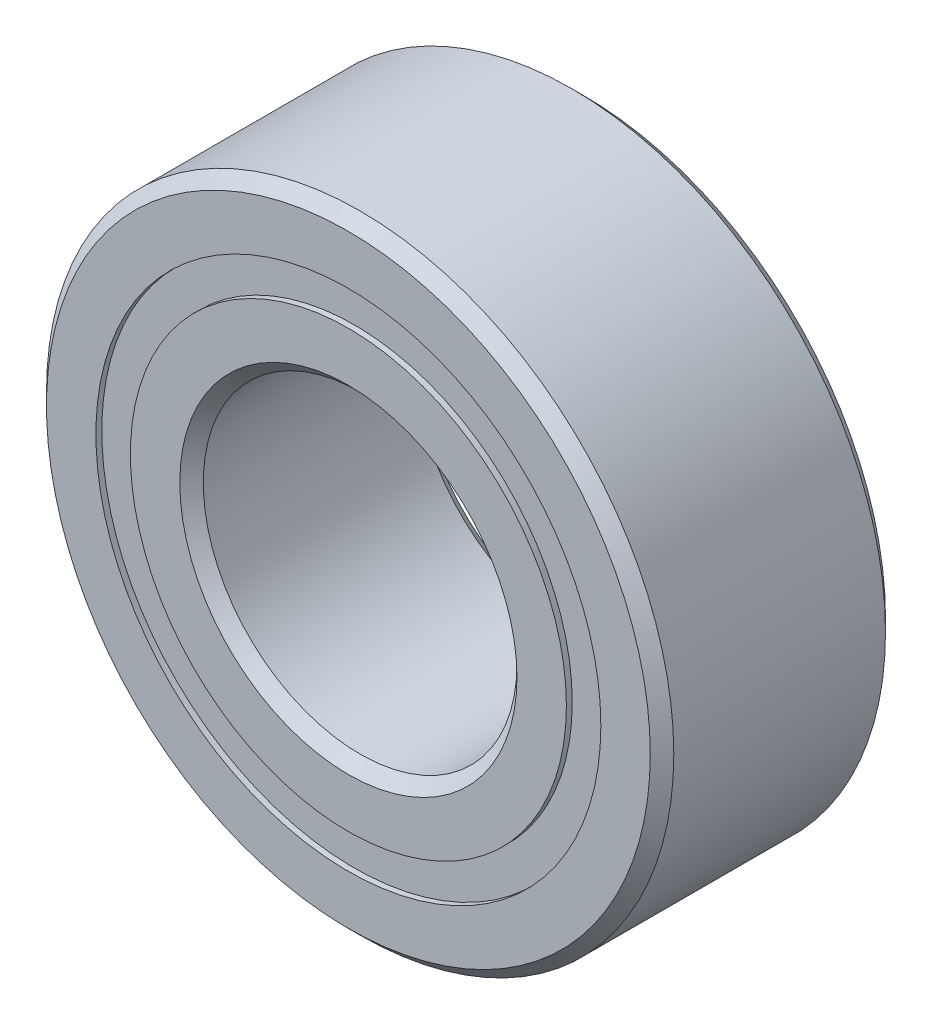
ISO-10303-21;
HEADER;
FILE_DESCRIPTION(('STEP AP214'),'2;1');
FILE_NAME('part.step','',(''),(''),'','','');
FILE_SCHEMA(('AUTOMOTIVE_DESIGN { 1 0 10303 214 1 1 1 1 }'));
ENDSEC;
DATA;
#1=APPLICATION_CONTEXT('core data for automotive mechanical design processes');
#2=APPLICATION_PROTOCOL_DEFINITION('international standard','automotive_design',2000,#1);
#3=PRODUCT_CONTEXT('',#1,'mechanical');
#4=PRODUCT('Part','Part','',(#3));
#5=PRODUCT_RELATED_PRODUCT_CATEGORY('part','',(#4));
#6=PRODUCT_DEFINITION_FORMATION('','',#4);
#7=PRODUCT_DEFINITION_CONTEXT('part definition',#1,'design');
#8=PRODUCT_DEFINITION('design','',#6,#7);
#9=PRODUCT_DEFINITION_SHAPE('','',#8);
#10=(LENGTH_UNIT() NAMED_UNIT(*) SI_UNIT(.MILLI.,.METRE.));
#11=(NAMED_UNIT(*) PLANE_ANGLE_UNIT() SI_UNIT($,.RADIAN.));
#12=(NAMED_UNIT(*) SI_UNIT($,.STERADIAN.) SOLID_ANGLE_UNIT());
#13=UNCERTAINTY_MEASURE_WITH_UNIT(LENGTH_MEASURE(1.E-05),#10,'distance_accuracy_value','');
#14=(GEOMETRIC_REPRESENTATION_CONTEXT(3) GLOBAL_UNCERTAINTY_ASSIGNED_CONTEXT((#13)) GLOBAL_UNIT_ASSIGNED_CONTEXT((#10,
#11,#12)) REPRESENTATION_CONTEXT('',''));
#15=CARTESIAN_POINT('',(0.,0.,0.));
#16=DIRECTION('',(0.,0.,1.));
#17=DIRECTION('',(1.,0.,0.));
#18=AXIS2_PLACEMENT_3D('',#15,#16,#17);
#19=CARTESIAN_POINT('',(0.,5.1114010989011,-2.2621875));
#20=DIRECTION('',(0.,0.,1.));
#21=DIRECTION('',(1.,0.,0.));
#22=AXIS2_PLACEMENT_3D('',#19,#20,#21);
#23=PLANE('',#22);
#24=CARTESIAN_POINT('',(0.,0.,-2.2621875));
#25=DIRECTION('',(0.,0.,1.));
#26=DIRECTION('',(1.,0.,0.));
#27=AXIS2_PLACEMENT_3D('',#24,#25,#26);
#28=CIRCLE('',#27,5.1114010989011);
#29=CARTESIAN_POINT('',(5.1114010989011,0.,-2.2621875));
#30=VERTEX_POINT('',#29);
#31=EDGE_CURVE('E58',#30,#30,#28,.T.);
#32=ORIENTED_EDGE('',*,*,#31,.F.);
#33=EDGE_LOOP('',(#32));
#34=FACE_BOUND('',#33,.T.);
#35=CARTESIAN_POINT('',(0.,0.,-2.2621875));
#36=DIRECTION('',(0.,0.,1.));
#37=DIRECTION('',(1.,0.,0.));
#38=AXIS2_PLACEMENT_3D('',#35,#36,#37);
#39=CIRCLE('',#38,4.4135989010989);
#40=CARTESIAN_POINT('',(4.4135989010989,0.,-2.2621875));
#41=VERTEX_POINT('',#40);
#42=EDGE_CURVE('E11',#41,#41,#39,.T.);
#43=ORIENTED_EDGE('',*,*,#42,.T.);
#44=EDGE_LOOP('',(#43));
#45=FACE_BOUND('',#44,.T.);
#46=ADVANCED_FACE('F44',(#34,#45),#23,.F.);
#47=CARTESIAN_POINT('',(0.,0.,2.38125));
#48=DIRECTION('',(0.,0.,1.));
#49=DIRECTION('',(1.,0.,0.));
#50=AXIS2_PLACEMENT_3D('',#47,#48,#49);
#51=CYLINDRICAL_SURFACE('',#50,4.4135989010989);
#52=ORIENTED_EDGE('',*,*,#42,.F.);
#53=EDGE_LOOP('',(#52));
#54=FACE_BOUND('',#53,.T.);
#55=CARTESIAN_POINT('',(0.,0.,-1.11436144103197));
#56=DIRECTION('',(0.,0.,1.));
#57=DIRECTION('',(1.,0.,0.));
#58=AXIS2_PLACEMENT_3D('',#55,#56,#57);
#59=CIRCLE('',#58,4.4135989010989);
#60=CARTESIAN_POINT('',(4.4135989010989,0.,-1.11436144103197));
#61=VERTEX_POINT('',#60);
#62=EDGE_CURVE('E50',#61,#61,#59,.T.);
#63=ORIENTED_EDGE('',*,*,#62,.T.);
#64=EDGE_LOOP('',(#63));
#65=FACE_BOUND('',#64,.T.);
#66=ADVANCED_FACE('F67',(#54,#65),#51,.F.);
#67=CARTESIAN_POINT('',(0.,5.1114010989011,-1.11436144103197));
#68=DIRECTION('',(0.,0.,-1.));
#69=DIRECTION('',(-1.,0.,0.));
#70=AXIS2_PLACEMENT_3D('',#67,#68,#69);
#71=PLANE('',#70);
#72=ORIENTED_EDGE('',*,*,#62,.F.);
#73=EDGE_LOOP('',(#72));
#74=FACE_BOUND('',#73,.T.);
#75=CARTESIAN_POINT('',(0.,0.,-1.11436144103197));
#76=DIRECTION('',(0.,0.,1.));
#77=DIRECTION('',(1.,0.,0.));
#78=AXIS2_PLACEMENT_3D('',#75,#76,#77);
#79=CIRCLE('',#78,5.1114010989011);
#80=CARTESIAN_POINT('',(5.1114010989011,0.,-1.11436144103197));
#81=VERTEX_POINT('',#80);
#82=EDGE_CURVE('E54',#81,#81,#79,.T.);
#83=ORIENTED_EDGE('',*,*,#82,.T.);
#84=EDGE_LOOP('',(#83));
#85=FACE_BOUND('',#84,.T.);
#86=ADVANCED_FACE('F71',(#74,#85),#71,.F.);
#87=CARTESIAN_POINT('',(0.,0.,2.38125));
#88=DIRECTION('',(0.,0.,1.));
#89=DIRECTION('',(1.,0.,0.));
#90=AXIS2_PLACEMENT_3D('',#87,#88,#89);
#91=CYLINDRICAL_SURFACE('',#90,5.1114010989011);
#92=ORIENTED_EDGE('',*,*,#82,.F.);
#93=EDGE_LOOP('',(#92));
#94=FACE_BOUND('',#93,.T.);
#95=ORIENTED_EDGE('',*,*,#31,.T.);
#96=EDGE_LOOP('',(#95));
#97=FACE_BOUND('',#96,.T.);
#98=ADVANCED_FACE('F64',(#94,#97),#91,.T.);
#99=CLOSED_SHELL('',(#46,#66,#86,#98));
#100=MANIFOLD_SOLID_BREP('B2',#99);
#101=CARTESIAN_POINT('',(0.,5.1114010989011,2.2621875));
#102=DIRECTION('',(0.,0.,-1.));
#103=DIRECTION('',(-1.,0.,0.));
#104=AXIS2_PLACEMENT_3D('',#101,#102,#103);
#105=PLANE('',#104);
#106=CARTESIAN_POINT('',(0.,0.,2.2621875));
#107=DIRECTION('',(0.,0.,1.));
#108=DIRECTION('',(1.,0.,0.));
#109=AXIS2_PLACEMENT_3D('',#106,#107,#108);
#110=CIRCLE('',#109,4.4135989010989);
#111=CARTESIAN_POINT('',(4.4135989010989,0.,2.2621875));
#112=VERTEX_POINT('',#111);
#113=EDGE_CURVE('E43',#112,#112,#110,.T.);
#114=ORIENTED_EDGE('',*,*,#113,.F.);
#115=EDGE_LOOP('',(#114));
#116=FACE_BOUND('',#115,.T.);
#117=CARTESIAN_POINT('',(0.,0.,2.2621875));
#118=DIRECTION('',(0.,0.,1.));
#119=DIRECTION('',(1.,0.,0.));
#120=AXIS2_PLACEMENT_3D('',#117,#118,#119);
#121=CIRCLE('',#120,5.1114010989011);
#122=CARTESIAN_POINT('',(5.1114010989011,0.,2.2621875));
#123=VERTEX_POINT('',#122);
#124=EDGE_CURVE('E126',#123,#123,#121,.T.);
#125=ORIENTED_EDGE('',*,*,#124,.T.);
#126=EDGE_LOOP('',(#125));
#127=FACE_BOUND('',#126,.T.);
#128=ADVANCED_FACE('F112',(#116,#127),#105,.F.);
#129=CARTESIAN_POINT('',(0.,0.,2.38125));
#130=DIRECTION('',(0.,0.,1.));
#131=DIRECTION('',(1.,0.,0.));
#132=AXIS2_PLACEMENT_3D('',#129,#130,#131);
#133=CYLINDRICAL_SURFACE('',#132,4.4135989010989);
#134=CARTESIAN_POINT('',(0.,0.,1.11436144103197));
#135=DIRECTION('',(0.,0.,1.));
#136=DIRECTION('',(1.,0.,0.));
#137=AXIS2_PLACEMENT_3D('',#134,#135,#136);
#138=CIRCLE('',#137,4.4135989010989);
#139=CARTESIAN_POINT('',(4.4135989010989,0.,1.11436144103197));
#140=VERTEX_POINT('',#139);
#141=EDGE_CURVE('E118',#140,#140,#138,.T.);
#142=ORIENTED_EDGE('',*,*,#141,.F.);
#143=EDGE_LOOP('',(#142));
#144=FACE_BOUND('',#143,.T.);
#145=ORIENTED_EDGE('',*,*,#113,.T.);
#146=EDGE_LOOP('',(#145));
#147=FACE_BOUND('',#146,.T.);
#148=ADVANCED_FACE('F141',(#144,#147),#133,.F.);
#149=CARTESIAN_POINT('',(0.,5.1114010989011,1.11436144103197));
#150=DIRECTION('',(0.,0.,1.));
#151=DIRECTION('',(1.,0.,0.));
#152=AXIS2_PLACEMENT_3D('',#149,#150,#151);
#153=PLANE('',#152);
#154=CARTESIAN_POINT('',(0.,0.,1.11436144103197));
#155=DIRECTION('',(0.,0.,1.));
#156=DIRECTION('',(1.,0.,0.));
#157=AXIS2_PLACEMENT_3D('',#154,#155,#156);
#158=CIRCLE('',#157,5.1114010989011);
#159=CARTESIAN_POINT('',(5.1114010989011,0.,1.11436144103197));
#160=VERTEX_POINT('',#159);
#161=EDGE_CURVE('E122',#160,#160,#158,.T.);
#162=ORIENTED_EDGE('',*,*,#161,.F.);
#163=EDGE_LOOP('',(#162));
#164=FACE_BOUND('',#163,.T.);
#165=ORIENTED_EDGE('',*,*,#141,.T.);
#166=EDGE_LOOP('',(#165));
#167=FACE_BOUND('',#166,.T.);
#168=ADVANCED_FACE('F136',(#164,#167),#153,.F.);
#169=CARTESIAN_POINT('',(0.,0.,2.38125));
#170=DIRECTION('',(0.,0.,1.));
#171=DIRECTION('',(1.,0.,0.));
#172=AXIS2_PLACEMENT_3D('',#169,#170,#171);
#173=CYLINDRICAL_SURFACE('',#172,5.1114010989011);
#174=ORIENTED_EDGE('',*,*,#124,.F.);
#175=EDGE_LOOP('',(#174));
#176=FACE_BOUND('',#175,.T.);
#177=ORIENTED_EDGE('',*,*,#161,.T.);
#178=EDGE_LOOP('',(#177));
#179=FACE_BOUND('',#178,.T.);
#180=ADVANCED_FACE('F133',(#176,#179),#173,.T.);
#181=CLOSED_SHELL('',(#128,#148,#168,#180));
#182=MANIFOLD_SOLID_BREP('B6',#181);
#183=CARTESIAN_POINT('',(-2.38124999999995,4.12444598552342,0.));
#184=DIRECTION('',(0.,0.,1.));
#185=DIRECTION('',(-0.499999999999989,0.866025403784445,0.));
#186=AXIS2_PLACEMENT_3D('',#183,#184,#185);
#187=SPHERICAL_SURFACE('',#186,1.11436144103197);
#188=CARTESIAN_POINT('',(-2.38124999999995,4.12444598552342,1.11436144103197));
#189=VERTEX_POINT('',#188);
#190=VERTEX_LOOP('',#189);
#191=FACE_BOUND('',#190,.T.);
#192=ADVANCED_FACE('F179',(#191),#187,.T.);
#193=CLOSED_SHELL('',(#192));
#194=MANIFOLD_SOLID_BREP('B38',#193);
#195=CARTESIAN_POINT('',(-4.12444598552336,2.38125000000005,0.));
#196=DIRECTION('',(0.,0.,1.));
#197=DIRECTION('',(-0.866025403784433,0.50000000000001,0.));
#198=AXIS2_PLACEMENT_3D('',#195,#196,#197);
#199=SPHERICAL_SURFACE('',#198,1.11436144103197);
#200=CARTESIAN_POINT('',(-4.12444598552336,2.38125000000005,1.11436144103197));
#201=VERTEX_POINT('',#200);
#202=VERTEX_LOOP('',#201);
#203=FACE_BOUND('',#202,.T.);
#204=ADVANCED_FACE('F199',(#203),#199,.T.);
#205=CLOSED_SHELL('',(#204));
#206=MANIFOLD_SOLID_BREP('B108',#205);
#207=CARTESIAN_POINT('',(-4.7625,0.,0.));
#208=DIRECTION('',(0.,0.,1.));
#209=DIRECTION('',(-1.,0.,0.));
#210=AXIS2_PLACEMENT_3D('',#207,#208,#209);
#211=SPHERICAL_SURFACE('',#210,1.11436144103197);
#212=CARTESIAN_POINT('',(-4.7625,0.,1.11436144103197));
#213=VERTEX_POINT('',#212);
#214=VERTEX_LOOP('',#213);
#215=FACE_BOUND('',#214,.T.);
#216=ADVANCED_FACE('F219',(#215),#211,.T.);
#217=CLOSED_SHELL('',(#216));
#218=MANIFOLD_SOLID_BREP('B175',#217);
#219=CARTESIAN_POINT('',(-4.12444598552341,-2.38124999999996,0.));
#220=DIRECTION('',(0.,0.,1.));
#221=DIRECTION('',(-0.866025403784443,-0.499999999999992,0.));
#222=AXIS2_PLACEMENT_3D('',#219,#220,#221);
#223=SPHERICAL_SURFACE('',#222,1.11436144103197);
#224=CARTESIAN_POINT('',(-4.12444598552341,-2.38124999999996,1.11436144103197));
#225=VERTEX_POINT('',#224);
#226=VERTEX_LOOP('',#225);
#227=FACE_BOUND('',#226,.T.);
#228=ADVANCED_FACE('F239',(#227),#223,.T.);
#229=CLOSED_SHELL('',(#228));
#230=MANIFOLD_SOLID_BREP('B195',#229);
#231=CARTESIAN_POINT('',(-2.38125000000003,-4.12444598552337,0.));
#232=DIRECTION('',(0.,0.,1.));
#233=DIRECTION('',(-0.500000000000007,-0.866025403784435,0.));
#234=AXIS2_PLACEMENT_3D('',#231,#232,#233);
#235=SPHERICAL_SURFACE('',#234,1.11436144103197);
#236=CARTESIAN_POINT('',(-2.38125000000003,-4.12444598552337,1.11436144103197));
#237=VERTEX_POINT('',#236);
#238=VERTEX_LOOP('',#237);
#239=FACE_BOUND('',#238,.T.);
#240=ADVANCED_FACE('F259',(#239),#235,.T.);
#241=CLOSED_SHELL('',(#240));
#242=MANIFOLD_SOLID_BREP('B215',#241);
#243=CARTESIAN_POINT('',(0.,-4.7625,0.));
#244=DIRECTION('',(0.,0.,1.));
#245=DIRECTION('',(0.,-1.,0.));
#246=AXIS2_PLACEMENT_3D('',#243,#244,#245);
#247=SPHERICAL_SURFACE('',#246,1.11436144103197);
#248=CARTESIAN_POINT('',(0.,-4.7625,1.11436144103197));
#249=VERTEX_POINT('',#248);
#250=VERTEX_LOOP('',#249);
#251=FACE_BOUND('',#250,.T.);
#252=ADVANCED_FACE('F279',(#251),#247,.T.);
#253=CLOSED_SHELL('',(#252));
#254=MANIFOLD_SOLID_BREP('B235',#253);
#255=CARTESIAN_POINT('',(2.38124999999998,-4.1244459855234,0.));
#256=DIRECTION('',(0.,0.,1.));
#257=DIRECTION('',(0.499999999999995,-0.866025403784442,0.));
#258=AXIS2_PLACEMENT_3D('',#255,#256,#257);
#259=SPHERICAL_SURFACE('',#258,1.11436144103197);
#260=CARTESIAN_POINT('',(2.38124999999998,-4.1244459855234,1.11436144103197));
#261=VERTEX_POINT('',#260);
#262=VERTEX_LOOP('',#261);
#263=FACE_BOUND('',#262,.T.);
#264=ADVANCED_FACE('F299',(#263),#259,.T.);
#265=CLOSED_SHELL('',(#264));
#266=MANIFOLD_SOLID_BREP('B255',#265);
#267=CARTESIAN_POINT('',(4.12444598552338,-2.38125000000002,0.));
#268=DIRECTION('',(0.,0.,1.));
#269=DIRECTION('',(0.866025403784436,-0.500000000000004,0.));
#270=AXIS2_PLACEMENT_3D('',#267,#268,#269);
#271=SPHERICAL_SURFACE('',#270,1.11436144103197);
#272=CARTESIAN_POINT('',(4.12444598552338,-2.38125000000002,1.11436144103197));
#273=VERTEX_POINT('',#272);
#274=VERTEX_LOOP('',#273);
#275=FACE_BOUND('',#274,.T.);
#276=ADVANCED_FACE('F319',(#275),#271,.T.);
#277=CLOSED_SHELL('',(#276));
#278=MANIFOLD_SOLID_BREP('B275',#277);
#279=CARTESIAN_POINT('',(4.7625,0.,0.));
#280=DIRECTION('',(0.,0.,1.));
#281=DIRECTION('',(1.,0.,0.));
#282=AXIS2_PLACEMENT_3D('',#279,#280,#281);
#283=SPHERICAL_SURFACE('',#282,1.11436144103197);
#284=CARTESIAN_POINT('',(4.7625,0.,1.11436144103197));
#285=VERTEX_POINT('',#284);
#286=VERTEX_LOOP('',#285);
#287=FACE_BOUND('',#286,.T.);
#288=ADVANCED_FACE('F339',(#287),#283,.T.);
#289=CLOSED_SHELL('',(#288));
#290=MANIFOLD_SOLID_BREP('B295',#289);
#291=CARTESIAN_POINT('',(4.12444598552339,2.38124999999999,0.));
#292=DIRECTION('',(0.,0.,1.));
#293=DIRECTION('',(0.86602540378444,0.499999999999998,0.));
#294=AXIS2_PLACEMENT_3D('',#291,#292,#293);
#295=SPHERICAL_SURFACE('',#294,1.11436144103197);
#296=CARTESIAN_POINT('',(4.12444598552339,2.38124999999999,1.11436144103197));
#297=VERTEX_POINT('',#296);
#298=VERTEX_LOOP('',#297);
#299=FACE_BOUND('',#298,.T.);
#300=ADVANCED_FACE('F359',(#299),#295,.T.);
#301=CLOSED_SHELL('',(#300));
#302=MANIFOLD_SOLID_BREP('B315',#301);
#303=CARTESIAN_POINT('',(2.38125,4.12444598552339,0.));
#304=DIRECTION('',(0.,0.,1.));
#305=DIRECTION('',(0.500000000000001,0.866025403784438,0.));
#306=AXIS2_PLACEMENT_3D('',#303,#304,#305);
#307=SPHERICAL_SURFACE('',#306,1.11436144103197);
#308=CARTESIAN_POINT('',(2.38125,4.12444598552339,1.11436144103197));
#309=VERTEX_POINT('',#308);
#310=VERTEX_LOOP('',#309);
#311=FACE_BOUND('',#310,.T.);
#312=ADVANCED_FACE('F379',(#311),#307,.T.);
#313=CLOSED_SHELL('',(#312));
#314=MANIFOLD_SOLID_BREP('B335',#313);
#315=CARTESIAN_POINT('',(0.,4.7625,0.));
#316=DIRECTION('',(0.,0.,1.));
#317=DIRECTION('',(0.,1.,0.));
#318=AXIS2_PLACEMENT_3D('',#315,#316,#317);
#319=SPHERICAL_SURFACE('',#318,1.11436144103197);
#320=CARTESIAN_POINT('',(0.,4.7625,1.11436144103197));
#321=VERTEX_POINT('',#320);
#322=VERTEX_LOOP('',#321);
#323=FACE_BOUND('',#322,.T.);
#324=ADVANCED_FACE('F402',(#323),#319,.T.);
#325=CLOSED_SHELL('',(#324));
#326=MANIFOLD_SOLID_BREP('B355',#325);
#327=CARTESIAN_POINT('',(0.,4.4135989010989,2.38125));
#328=DIRECTION('',(0.,0.,-1.));
#329=DIRECTION('',(-1.,0.,0.));
#330=AXIS2_PLACEMENT_3D('',#327,#328,#329);
#331=PLANE('',#330);
#332=CARTESIAN_POINT('',(0.,0.,2.38125));
#333=DIRECTION('',(0.,0.,1.));
#334=DIRECTION('',(1.,0.,0.));
#335=AXIS2_PLACEMENT_3D('',#332,#333,#334);
#336=CIRCLE('',#335,3.413125);
#337=CARTESIAN_POINT('',(3.413125,0.,2.38125));
#338=VERTEX_POINT('',#337);
#339=EDGE_CURVE('E450',#338,#338,#336,.T.);
#340=ORIENTED_EDGE('',*,*,#339,.F.);
#341=EDGE_LOOP('',(#340));
#342=FACE_BOUND('',#341,.T.);
#343=CARTESIAN_POINT('',(0.,0.,2.38125));
#344=DIRECTION('',(0.,0.,1.));
#345=DIRECTION('',(1.,0.,0.));
#346=AXIS2_PLACEMENT_3D('',#343,#344,#345);
#347=CIRCLE('',#346,4.4135989010989);
#348=CARTESIAN_POINT('',(4.4135989010989,0.,2.38125));
#349=VERTEX_POINT('',#348);
#350=EDGE_CURVE('E401',#349,#349,#347,.T.);
#351=ORIENTED_EDGE('',*,*,#350,.T.);
#352=EDGE_LOOP('',(#351));
#353=FACE_BOUND('',#352,.T.);
#354=ADVANCED_FACE('F422',(#342,#353),#331,.F.);
#355=CARTESIAN_POINT('',(0.,0.,2.38125));
#356=DIRECTION('',(0.,0.,1.));
#357=DIRECTION('',(1.,0.,0.));
#358=AXIS2_PLACEMENT_3D('',#355,#356,#357);
#359=CYLINDRICAL_SURFACE('',#358,4.4135989010989);
#360=ORIENTED_EDGE('',*,*,#350,.F.);
#361=EDGE_LOOP('',(#360));
#362=FACE_BOUND('',#361,.T.);
#363=CARTESIAN_POINT('',(0.,0.,1.05833333333333));
#364=DIRECTION('',(0.,0.,1.));
#365=DIRECTION('',(1.,0.,0.));
#366=AXIS2_PLACEMENT_3D('',#363,#364,#365);
#367=CIRCLE('',#366,4.4135989010989);
#368=CARTESIAN_POINT('',(4.4135989010989,0.,1.05833333333333));
#369=VERTEX_POINT('',#368);
#370=EDGE_CURVE('E428',#369,#369,#367,.T.);
#371=ORIENTED_EDGE('',*,*,#370,.T.);
#372=EDGE_LOOP('',(#371));
#373=FACE_BOUND('',#372,.T.);
#374=ADVANCED_FACE('F457',(#362,#373),#359,.T.);
#375=CARTESIAN_POINT('',(0.,0.,0.));
#376=DIRECTION('',(0.,0.,1.));
#377=DIRECTION('',(1.,0.,0.));
#378=AXIS2_PLACEMENT_3D('',#375,#376,#377);
#379=TOROIDAL_SURFACE('',#378,4.7625,1.11436144103196);
#380=ORIENTED_EDGE('',*,*,#370,.F.);
#381=EDGE_LOOP('',(#380));
#382=FACE_BOUND('',#381,.T.);
#383=CARTESIAN_POINT('',(0.,0.,-1.05833333333333));
#384=DIRECTION('',(0.,0.,1.));
#385=DIRECTION('',(1.,0.,0.));
#386=AXIS2_PLACEMENT_3D('',#383,#384,#385);
#387=CIRCLE('',#386,4.4135989010989);
#388=CARTESIAN_POINT('',(4.4135989010989,0.,-1.05833333333333));
#389=VERTEX_POINT('',#388);
#390=EDGE_CURVE('E432',#389,#389,#387,.T.);
#391=ORIENTED_EDGE('',*,*,#390,.T.);
#392=EDGE_LOOP('',(#391));
#393=FACE_BOUND('',#392,.T.);
#394=ADVANCED_FACE('F461',(#382,#393),#379,.F.);
#395=CARTESIAN_POINT('',(0.,0.,2.38125));
#396=DIRECTION('',(0.,0.,1.));
#397=DIRECTION('',(1.,0.,0.));
#398=AXIS2_PLACEMENT_3D('',#395,#396,#397);
#399=CYLINDRICAL_SURFACE('',#398,4.4135989010989);
#400=ORIENTED_EDGE('',*,*,#390,.F.);
#401=EDGE_LOOP('',(#400));
#402=FACE_BOUND('',#401,.T.);
#403=CARTESIAN_POINT('',(0.,0.,-2.38125));
#404=DIRECTION('',(0.,0.,1.));
#405=DIRECTION('',(1.,0.,0.));
#406=AXIS2_PLACEMENT_3D('',#403,#404,#405);
#407=CIRCLE('',#406,4.4135989010989);
#408=CARTESIAN_POINT('',(4.4135989010989,0.,-2.38125));
#409=VERTEX_POINT('',#408);
#410=EDGE_CURVE('E436',#409,#409,#407,.T.);
#411=ORIENTED_EDGE('',*,*,#410,.T.);
#412=EDGE_LOOP('',(#411));
#413=FACE_BOUND('',#412,.T.);
#414=ADVANCED_FACE('F466',(#402,#413),#399,.T.);
#415=CARTESIAN_POINT('',(0.,3.413125,-2.38125));
#416=DIRECTION('',(0.,0.,1.));
#417=DIRECTION('',(1.,0.,0.));
#418=AXIS2_PLACEMENT_3D('',#415,#416,#417);
#419=PLANE('',#418);
#420=ORIENTED_EDGE('',*,*,#410,.F.);
#421=EDGE_LOOP('',(#420));
#422=FACE_BOUND('',#421,.T.);
#423=CARTESIAN_POINT('',(0.,0.,-2.38125));
#424=DIRECTION('',(0.,0.,1.));
#425=DIRECTION('',(1.,0.,0.));
#426=AXIS2_PLACEMENT_3D('',#423,#424,#425);
#427=CIRCLE('',#426,3.413125);
#428=CARTESIAN_POINT('',(3.413125,0.,-2.38125));
#429=VERTEX_POINT('',#428);
#430=EDGE_CURVE('E441',#429,#429,#427,.T.);
#431=ORIENTED_EDGE('',*,*,#430,.T.);
#432=EDGE_LOOP('',(#431));
#433=FACE_BOUND('',#432,.T.);
#434=ADVANCED_FACE('F472',(#422,#433),#419,.F.);
#435=CARTESIAN_POINT('',(0.,0.,-2.143125));
#436=DIRECTION('',(0.,0.,-1.));
#437=DIRECTION('',(-1.,0.,0.));
#438=AXIS2_PLACEMENT_3D('',#435,#436,#437);
#439=CONICAL_SURFACE('',#438,3.175,0.785398163397445);
#440=ORIENTED_EDGE('',*,*,#430,.F.);
#441=EDGE_LOOP('',(#440));
#442=FACE_BOUND('',#441,.T.);
#443=CARTESIAN_POINT('',(0.,0.,-2.143125));
#444=DIRECTION('',(0.,0.,1.));
#445=DIRECTION('',(1.,0.,0.));
#446=AXIS2_PLACEMENT_3D('',#443,#444,#445);
#447=CIRCLE('',#446,3.175);
#448=CARTESIAN_POINT('',(3.175,0.,-2.143125));
#449=VERTEX_POINT('',#448);
#450=EDGE_CURVE('E444',#449,#449,#447,.T.);
#451=ORIENTED_EDGE('',*,*,#450,.T.);
#452=EDGE_LOOP('',(#451));
#453=FACE_BOUND('',#452,.T.);
#454=ADVANCED_FACE('F476',(#442,#453),#439,.F.);
#455=CARTESIAN_POINT('',(0.,0.,2.38125));
#456=DIRECTION('',(0.,0.,1.));
#457=DIRECTION('',(1.,0.,0.));
#458=AXIS2_PLACEMENT_3D('',#455,#456,#457);
#459=CYLINDRICAL_SURFACE('',#458,3.175);
#460=ORIENTED_EDGE('',*,*,#450,.F.);
#461=EDGE_LOOP('',(#460));
#462=FACE_BOUND('',#461,.T.);
#463=CARTESIAN_POINT('',(0.,0.,2.143125));
#464=DIRECTION('',(0.,0.,1.));
#465=DIRECTION('',(1.,0.,0.));
#466=AXIS2_PLACEMENT_3D('',#463,#464,#465);
#467=CIRCLE('',#466,3.175);
#468=CARTESIAN_POINT('',(3.175,0.,2.143125));
#469=VERTEX_POINT('',#468);
#470=EDGE_CURVE('E447',#469,#469,#467,.T.);
#471=ORIENTED_EDGE('',*,*,#470,.T.);
#472=EDGE_LOOP('',(#471));
#473=FACE_BOUND('',#472,.T.);
#474=ADVANCED_FACE('F480',(#462,#473),#459,.F.);
#475=CARTESIAN_POINT('',(0.,0.,2.38125));
#476=DIRECTION('',(0.,0.,1.));
#477=DIRECTION('',(1.,0.,0.));
#478=AXIS2_PLACEMENT_3D('',#475,#476,#477);
#479=CONICAL_SURFACE('',#478,3.413125,0.785398163397449);
#480=ORIENTED_EDGE('',*,*,#470,.F.);
#481=EDGE_LOOP('',(#480));
#482=FACE_BOUND('',#481,.T.);
#483=ORIENTED_EDGE('',*,*,#339,.T.);
#484=EDGE_LOOP('',(#483));
#485=FACE_BOUND('',#484,.T.);
#486=ADVANCED_FACE('F454',(#482,#485),#479,.F.);
#487=CLOSED_SHELL('',(#354,#374,#394,#414,#434,#454,#474,#486));
#488=MANIFOLD_SOLID_BREP('B375',#487);
#489=CARTESIAN_POINT('',(0.,0.,2.143125));
#490=DIRECTION('',(0.,0.,-1.));
#491=DIRECTION('',(-1.,0.,0.));
#492=AXIS2_PLACEMENT_3D('',#489,#490,#491);
#493=CONICAL_SURFACE('',#492,6.35,0.785398163397447);
#494=CARTESIAN_POINT('',(0.,0.,2.38125));
#495=DIRECTION('',(0.,0.,1.));
#496=DIRECTION('',(1.,0.,0.));
#497=AXIS2_PLACEMENT_3D('',#494,#495,#496);
#498=CIRCLE('',#497,6.111875);
#499=CARTESIAN_POINT('',(6.111875,0.,2.38125));
#500=VERTEX_POINT('',#499);
#501=EDGE_CURVE('E572',#500,#500,#498,.T.);
#502=ORIENTED_EDGE('',*,*,#501,.F.);
#503=EDGE_LOOP('',(#502));
#504=FACE_BOUND('',#503,.T.);
#505=CARTESIAN_POINT('',(0.,0.,2.143125));
#506=DIRECTION('',(0.,0.,1.));
#507=DIRECTION('',(1.,0.,0.));
#508=AXIS2_PLACEMENT_3D('',#505,#506,#507);
#509=CIRCLE('',#508,6.35);
#510=CARTESIAN_POINT('',(6.35,0.,2.143125));
#511=VERTEX_POINT('',#510);
#512=EDGE_CURVE('E421',#511,#511,#509,.T.);
#513=ORIENTED_EDGE('',*,*,#512,.T.);
#514=EDGE_LOOP('',(#513));
#515=FACE_BOUND('',#514,.T.);
#516=ADVANCED_FACE('F544',(#504,#515),#493,.T.);
#517=CARTESIAN_POINT('',(0.,0.,2.38125));
#518=DIRECTION('',(0.,0.,1.));
#519=DIRECTION('',(1.,0.,0.));
#520=AXIS2_PLACEMENT_3D('',#517,#518,#519);
#521=CYLINDRICAL_SURFACE('',#520,6.35);
#522=ORIENTED_EDGE('',*,*,#512,.F.);
#523=EDGE_LOOP('',(#522));
#524=FACE_BOUND('',#523,.T.);
#525=CARTESIAN_POINT('',(0.,0.,-2.143125));
#526=DIRECTION('',(0.,0.,1.));
#527=DIRECTION('',(1.,0.,0.));
#528=AXIS2_PLACEMENT_3D('',#525,#526,#527);
#529=CIRCLE('',#528,6.35);
#530=CARTESIAN_POINT('',(6.35,0.,-2.143125));
#531=VERTEX_POINT('',#530);
#532=EDGE_CURVE('E550',#531,#531,#529,.T.);
#533=ORIENTED_EDGE('',*,*,#532,.T.);
#534=EDGE_LOOP('',(#533));
#535=FACE_BOUND('',#534,.T.);
#536=ADVANCED_FACE('F579',(#524,#535),#521,.T.);
#537=CARTESIAN_POINT('',(0.,0.,-2.38125));
#538=DIRECTION('',(0.,0.,1.));
#539=DIRECTION('',(1.,0.,0.));
#540=AXIS2_PLACEMENT_3D('',#537,#538,#539);
#541=CONICAL_SURFACE('',#540,6.111875,0.785398163397445);
#542=ORIENTED_EDGE('',*,*,#532,.F.);
#543=EDGE_LOOP('',(#542));
#544=FACE_BOUND('',#543,.T.);
#545=CARTESIAN_POINT('',(0.,0.,-2.38125));
#546=DIRECTION('',(0.,0.,1.));
#547=DIRECTION('',(1.,0.,0.));
#548=AXIS2_PLACEMENT_3D('',#545,#546,#547);
#549=CIRCLE('',#548,6.111875);
#550=CARTESIAN_POINT('',(6.111875,0.,-2.38125));
#551=VERTEX_POINT('',#550);
#552=EDGE_CURVE('E554',#551,#551,#549,.T.);
#553=ORIENTED_EDGE('',*,*,#552,.T.);
#554=EDGE_LOOP('',(#553));
#555=FACE_BOUND('',#554,.T.);
#556=ADVANCED_FACE('F583',(#544,#555),#541,.T.);
#557=CARTESIAN_POINT('',(0.,6.111875,-2.38125));
#558=DIRECTION('',(0.,0.,1.));
#559=DIRECTION('',(1.,0.,0.));
#560=AXIS2_PLACEMENT_3D('',#557,#558,#559);
#561=PLANE('',#560);
#562=ORIENTED_EDGE('',*,*,#552,.F.);
#563=EDGE_LOOP('',(#562));
#564=FACE_BOUND('',#563,.T.);
#565=CARTESIAN_POINT('',(0.,0.,-2.38125));
#566=DIRECTION('',(0.,0.,1.));
#567=DIRECTION('',(1.,0.,0.));
#568=AXIS2_PLACEMENT_3D('',#565,#566,#567);
#569=CIRCLE('',#568,5.1114010989011);
#570=CARTESIAN_POINT('',(5.1114010989011,0.,-2.38125));
#571=VERTEX_POINT('',#570);
#572=EDGE_CURVE('E558',#571,#571,#569,.T.);
#573=ORIENTED_EDGE('',*,*,#572,.T.);
#574=EDGE_LOOP('',(#573));
#575=FACE_BOUND('',#574,.T.);
#576=ADVANCED_FACE('F588',(#564,#575),#561,.F.);
#577=CARTESIAN_POINT('',(0.,0.,2.38125));
#578=DIRECTION('',(0.,0.,1.));
#579=DIRECTION('',(1.,0.,0.));
#580=AXIS2_PLACEMENT_3D('',#577,#578,#579);
#581=CYLINDRICAL_SURFACE('',#580,5.1114010989011);
#582=ORIENTED_EDGE('',*,*,#572,.F.);
#583=EDGE_LOOP('',(#582));
#584=FACE_BOUND('',#583,.T.);
#585=CARTESIAN_POINT('',(0.,0.,-1.05833333333333));
#586=DIRECTION('',(0.,0.,1.));
#587=DIRECTION('',(1.,0.,0.));
#588=AXIS2_PLACEMENT_3D('',#585,#586,#587);
#589=CIRCLE('',#588,5.1114010989011);
#590=CARTESIAN_POINT('',(5.1114010989011,0.,-1.05833333333333));
#591=VERTEX_POINT('',#590);
#592=EDGE_CURVE('E563',#591,#591,#589,.T.);
#593=ORIENTED_EDGE('',*,*,#592,.T.);
#594=EDGE_LOOP('',(#593));
#595=FACE_BOUND('',#594,.T.);
#596=ADVANCED_FACE('F594',(#584,#595),#581,.F.);
#597=CARTESIAN_POINT('',(0.,0.,0.));
#598=DIRECTION('',(0.,0.,1.));
#599=DIRECTION('',(1.,0.,0.));
#600=AXIS2_PLACEMENT_3D('',#597,#598,#599);
#601=TOROIDAL_SURFACE('',#600,4.7625,1.11436144103197);
#602=ORIENTED_EDGE('',*,*,#592,.F.);
#603=EDGE_LOOP('',(#602));
#604=FACE_BOUND('',#603,.T.);
#605=CARTESIAN_POINT('',(0.,0.,1.05833333333333));
#606=DIRECTION('',(0.,0.,1.));
#607=DIRECTION('',(1.,0.,0.));
#608=AXIS2_PLACEMENT_3D('',#605,#606,#607);
#609=CIRCLE('',#608,5.1114010989011);
#610=CARTESIAN_POINT('',(5.1114010989011,0.,1.05833333333333));
#611=VERTEX_POINT('',#610);
#612=EDGE_CURVE('E566',#611,#611,#609,.T.);
#613=ORIENTED_EDGE('',*,*,#612,.T.);
#614=EDGE_LOOP('',(#613));
#615=FACE_BOUND('',#614,.T.);
#616=ADVANCED_FACE('F598',(#604,#615),#601,.F.);
#617=CARTESIAN_POINT('',(0.,0.,2.38125));
#618=DIRECTION('',(0.,0.,1.));
#619=DIRECTION('',(1.,0.,0.));
#620=AXIS2_PLACEMENT_3D('',#617,#618,#619);
#621=CYLINDRICAL_SURFACE('',#620,5.1114010989011);
#622=ORIENTED_EDGE('',*,*,#612,.F.);
#623=EDGE_LOOP('',(#622));
#624=FACE_BOUND('',#623,.T.);
#625=CARTESIAN_POINT('',(0.,0.,2.38125));
#626=DIRECTION('',(0.,0.,1.));
#627=DIRECTION('',(1.,0.,0.));
#628=AXIS2_PLACEMENT_3D('',#625,#626,#627);
#629=CIRCLE('',#628,5.1114010989011);
#630=CARTESIAN_POINT('',(5.1114010989011,0.,2.38125));
#631=VERTEX_POINT('',#630);
#632=EDGE_CURVE('E569',#631,#631,#629,.T.);
#633=ORIENTED_EDGE('',*,*,#632,.T.);
#634=EDGE_LOOP('',(#633));
#635=FACE_BOUND('',#634,.T.);
#636=ADVANCED_FACE('F602',(#624,#635),#621,.F.);
#637=CARTESIAN_POINT('',(0.,6.111875,2.38125));
#638=DIRECTION('',(0.,0.,-1.));
#639=DIRECTION('',(-1.,0.,0.));
#640=AXIS2_PLACEMENT_3D('',#637,#638,#639);
#641=PLANE('',#640);
#642=ORIENTED_EDGE('',*,*,#632,.F.);
#643=EDGE_LOOP('',(#642));
#644=FACE_BOUND('',#643,.T.);
#645=ORIENTED_EDGE('',*,*,#501,.T.);
#646=EDGE_LOOP('',(#645));
#647=FACE_BOUND('',#646,.T.);
#648=ADVANCED_FACE('F576',(#644,#647),#641,.F.);
#649=CLOSED_SHELL('',(#516,#536,#556,#576,#596,#616,#636,#648));
#650=MANIFOLD_SOLID_BREP('B396',#649);
#651=ADVANCED_BREP_SHAPE_REPRESENTATION('',(#18,#100,#182,#194,#206,#218,#230,#242,#254,#266,
#278,#290,#302,#314,#326,#488,#650),#14);
#652=SHAPE_DEFINITION_REPRESENTATION(#9,#651);
ENDSEC;
END-ISO-10303-21;
